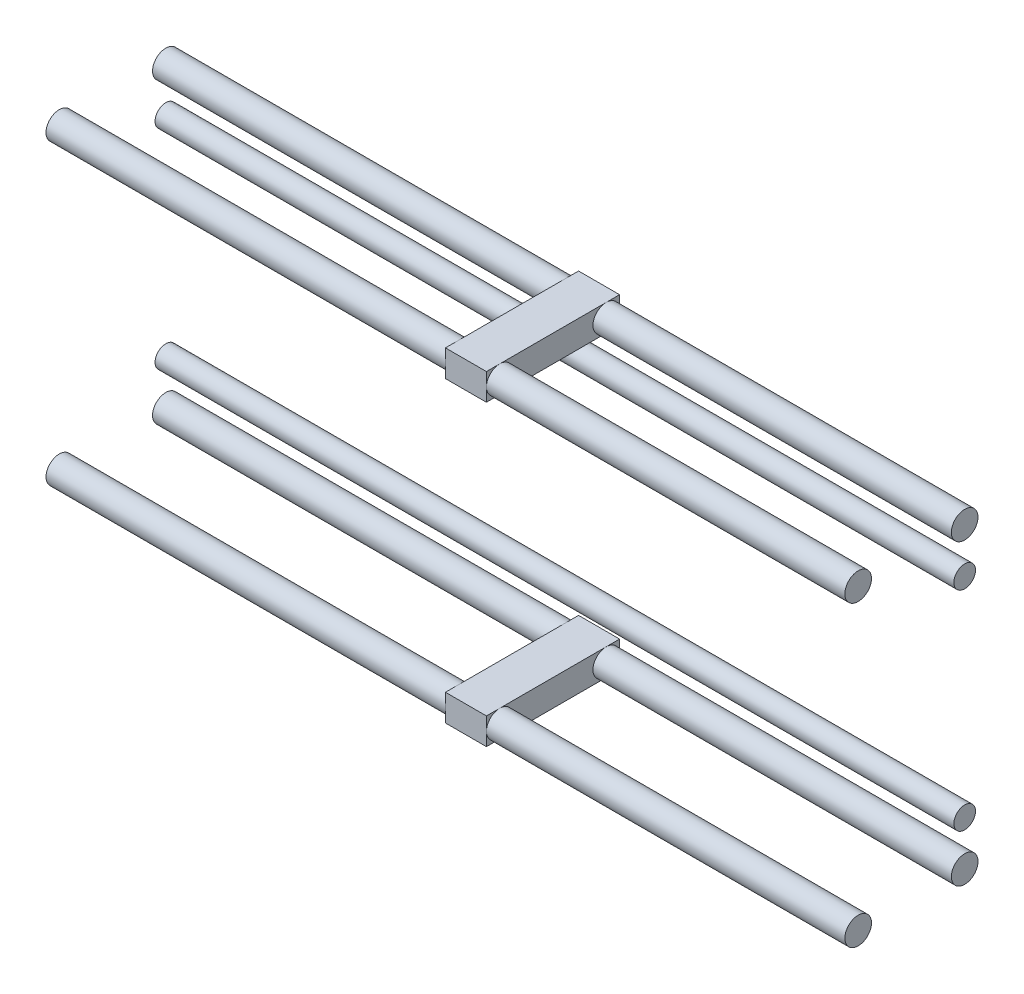
ISO-10303-21;
HEADER;
FILE_DESCRIPTION(('STEP AP214'),'2;1');
FILE_NAME('part.step','',(''),(''),'','','');
FILE_SCHEMA(('AUTOMOTIVE_DESIGN { 1 0 10303 214 1 1 1 1 }'));
ENDSEC;
DATA;
#1=APPLICATION_CONTEXT('core data for automotive mechanical design processes');
#2=APPLICATION_PROTOCOL_DEFINITION('international standard','automotive_design',2000,#1);
#3=PRODUCT_CONTEXT('',#1,'mechanical');
#4=PRODUCT('Part','Part','',(#3));
#5=PRODUCT_RELATED_PRODUCT_CATEGORY('part','',(#4));
#6=PRODUCT_DEFINITION_FORMATION('','',#4);
#7=PRODUCT_DEFINITION_CONTEXT('part definition',#1,'design');
#8=PRODUCT_DEFINITION('design','',#6,#7);
#9=PRODUCT_DEFINITION_SHAPE('','',#8);
#10=(LENGTH_UNIT() NAMED_UNIT(*) SI_UNIT(.MILLI.,.METRE.));
#11=(NAMED_UNIT(*) PLANE_ANGLE_UNIT() SI_UNIT($,.RADIAN.));
#12=(NAMED_UNIT(*) SI_UNIT($,.STERADIAN.) SOLID_ANGLE_UNIT());
#13=UNCERTAINTY_MEASURE_WITH_UNIT(LENGTH_MEASURE(1.E-05),#10,'distance_accuracy_value','');
#14=(GEOMETRIC_REPRESENTATION_CONTEXT(3) GLOBAL_UNCERTAINTY_ASSIGNED_CONTEXT((#13)) GLOBAL_UNIT_ASSIGNED_CONTEXT((#10,
#11,#12)) REPRESENTATION_CONTEXT('',''));
#15=CARTESIAN_POINT('',(0.,0.,0.));
#16=DIRECTION('',(0.,0.,1.));
#17=DIRECTION('',(1.,0.,0.));
#18=AXIS2_PLACEMENT_3D('',#15,#16,#17);
#19=CARTESIAN_POINT('',(-75.,-3.26576754328882,-12.1284424453869));
#20=DIRECTION('',(1.,0.,0.));
#21=DIRECTION('',(0.,0.,-1.));
#22=AXIS2_PLACEMENT_3D('',#19,#20,#21);
#23=CYLINDRICAL_SURFACE('',#22,2.03);
#24=CARTESIAN_POINT('',(-75.,-3.26576754328882,-12.1284424453869));
#25=DIRECTION('',(-1.,0.,0.));
#26=DIRECTION('',(0.,0.,1.));
#27=AXIS2_PLACEMENT_3D('',#24,#25,#26);
#28=CIRCLE('',#27,2.03);
#29=CARTESIAN_POINT('',(-75.,-3.26576754328882,-10.0984424453869));
#30=VERTEX_POINT('',#29);
#31=EDGE_CURVE('E52',#30,#30,#28,.T.);
#32=ORIENTED_EDGE('',*,*,#31,.F.);
#33=EDGE_LOOP('',(#32));
#34=FACE_BOUND('',#33,.T.);
#35=CARTESIAN_POINT('',(75.,-3.26576754328882,-12.1284424453869));
#36=DIRECTION('',(-1.,0.,0.));
#37=DIRECTION('',(0.,0.,1.));
#38=AXIS2_PLACEMENT_3D('',#35,#36,#37);
#39=CIRCLE('',#38,2.03);
#40=CARTESIAN_POINT('',(75.,-3.26576754328882,-10.0984424453869));
#41=VERTEX_POINT('',#40);
#42=EDGE_CURVE('E11',#41,#41,#39,.T.);
#43=ORIENTED_EDGE('',*,*,#42,.T.);
#44=EDGE_LOOP('',(#43));
#45=FACE_BOUND('',#44,.T.);
#46=ADVANCED_FACE('F48',(#34,#45),#23,.T.);
#47=CARTESIAN_POINT('',(-75.,-3.26576754328882,-12.1284424453869));
#48=DIRECTION('',(-1.,0.,0.));
#49=DIRECTION('',(0.,0.,1.));
#50=AXIS2_PLACEMENT_3D('',#47,#48,#49);
#51=PLANE('',#50);
#52=ORIENTED_EDGE('',*,*,#31,.T.);
#53=EDGE_LOOP('',(#52));
#54=FACE_BOUND('',#53,.T.);
#55=ADVANCED_FACE('F50',(#54),#51,.T.);
#56=CARTESIAN_POINT('',(75.,-3.26576754328882,-12.1284424453869));
#57=DIRECTION('',(-1.,0.,0.));
#58=DIRECTION('',(0.,0.,1.));
#59=AXIS2_PLACEMENT_3D('',#56,#57,#58);
#60=PLANE('',#59);
#61=ORIENTED_EDGE('',*,*,#42,.F.);
#62=EDGE_LOOP('',(#61));
#63=FACE_BOUND('',#62,.T.);
#64=ADVANCED_FACE('F67',(#63),#60,.F.);
#65=CLOSED_SHELL('',(#46,#55,#64));
#66=MANIFOLD_SOLID_BREP('B2',#65);
#67=CARTESIAN_POINT('',(-75.,35.9342324567112,-12.1284424453869));
#68=DIRECTION('',(1.,0.,0.));
#69=DIRECTION('',(0.,0.,-1.));
#70=AXIS2_PLACEMENT_3D('',#67,#68,#69);
#71=CYLINDRICAL_SURFACE('',#70,2.03);
#72=CARTESIAN_POINT('',(-75.,35.9342324567112,-12.1284424453869));
#73=DIRECTION('',(-1.,0.,0.));
#74=DIRECTION('',(0.,0.,1.));
#75=AXIS2_PLACEMENT_3D('',#72,#73,#74);
#76=CIRCLE('',#75,2.03);
#77=CARTESIAN_POINT('',(-75.,35.9342324567112,-10.0984424453869));
#78=VERTEX_POINT('',#77);
#79=EDGE_CURVE('E109',#78,#78,#76,.T.);
#80=ORIENTED_EDGE('',*,*,#79,.F.);
#81=EDGE_LOOP('',(#80));
#82=FACE_BOUND('',#81,.T.);
#83=CARTESIAN_POINT('',(75.,35.9342324567112,-12.1284424453869));
#84=DIRECTION('',(-1.,0.,0.));
#85=DIRECTION('',(0.,0.,1.));
#86=AXIS2_PLACEMENT_3D('',#83,#84,#85);
#87=CIRCLE('',#86,2.03);
#88=CARTESIAN_POINT('',(75.,35.9342324567112,-10.0984424453869));
#89=VERTEX_POINT('',#88);
#90=EDGE_CURVE('E47',#89,#89,#87,.T.);
#91=ORIENTED_EDGE('',*,*,#90,.T.);
#92=EDGE_LOOP('',(#91));
#93=FACE_BOUND('',#92,.T.);
#94=ADVANCED_FACE('F105',(#82,#93),#71,.T.);
#95=CARTESIAN_POINT('',(-75.,35.9342324567112,-12.1284424453869));
#96=DIRECTION('',(-1.,0.,0.));
#97=DIRECTION('',(0.,0.,1.));
#98=AXIS2_PLACEMENT_3D('',#95,#96,#97);
#99=PLANE('',#98);
#100=ORIENTED_EDGE('',*,*,#79,.T.);
#101=EDGE_LOOP('',(#100));
#102=FACE_BOUND('',#101,.T.);
#103=ADVANCED_FACE('F107',(#102),#99,.T.);
#104=CARTESIAN_POINT('',(75.,35.9342324567112,-12.1284424453869));
#105=DIRECTION('',(-1.,0.,0.));
#106=DIRECTION('',(0.,0.,1.));
#107=AXIS2_PLACEMENT_3D('',#104,#105,#106);
#108=PLANE('',#107);
#109=ORIENTED_EDGE('',*,*,#90,.F.);
#110=EDGE_LOOP('',(#109));
#111=FACE_BOUND('',#110,.T.);
#112=ADVANCED_FACE('F124',(#111),#108,.F.);
#113=CLOSED_SHELL('',(#94,#103,#112));
#114=MANIFOLD_SOLID_BREP('B6',#113);
#115=CARTESIAN_POINT('',(7.7,0.,0.));
#116=DIRECTION('',(-1.,0.,0.));
#117=DIRECTION('',(0.,0.,1.));
#118=AXIS2_PLACEMENT_3D('',#115,#116,#117);
#119=PLANE('',#118);
#120=CARTESIAN_POINT('',(7.7,44.3342324567112,7.87155755461312));
#121=DIRECTION('',(-1.,0.,0.));
#122=DIRECTION('',(0.,0.,1.));
#123=AXIS2_PLACEMENT_3D('',#120,#121,#122);
#124=CIRCLE('',#123,2.5);
#125=CARTESIAN_POINT('',(7.7,44.3342324567112,10.3715575546131));
#126=VERTEX_POINT('',#125);
#127=CARTESIAN_POINT('',(7.7,41.8342324567112,7.87155755461312));
#128=VERTEX_POINT('',#127);
#129=EDGE_CURVE('E319',#126,#128,#124,.F.);
#130=ORIENTED_EDGE('',*,*,#129,.F.);
#131=DIRECTION('',(0.,1.,0.));
#132=VECTOR('',#131,1.);
#133=CARTESIAN_POINT('',(7.7,41.8342324567112,10.3715575546131));
#134=LINE('',#133,#132);
#135=CARTESIAN_POINT('',(7.7,41.8342324567112,10.3715575546131));
#136=VERTEX_POINT('',#135);
#137=EDGE_CURVE('E401',#136,#126,#134,.T.);
#138=ORIENTED_EDGE('',*,*,#137,.F.);
#139=DIRECTION('',(0.,0.,-1.));
#140=VECTOR('',#139,1.);
#141=CARTESIAN_POINT('',(7.7,41.8342324567112,10.3715575546131));
#142=LINE('',#141,#140);
#143=EDGE_CURVE('E387',#136,#128,#142,.T.);
#144=ORIENTED_EDGE('',*,*,#143,.T.);
#145=EDGE_LOOP('',(#130,#138,#144));
#146=FACE_BOUND('',#145,.T.);
#147=ADVANCED_FACE('F161',(#146),#119,.F.);
#148=CARTESIAN_POINT('',(7.7,46.8342324567112,7.87155755461312));
#149=VERTEX_POINT('',#148);
#150=EDGE_CURVE('E178',#128,#149,#124,.F.);
#151=ORIENTED_EDGE('',*,*,#150,.F.);
#152=CARTESIAN_POINT('',(7.7,41.8342324567112,-12.1284424453869));
#153=VERTEX_POINT('',#152);
#154=EDGE_CURVE('E405',#128,#153,#142,.T.);
#155=ORIENTED_EDGE('',*,*,#154,.T.);
#156=CARTESIAN_POINT('',(7.7,44.3342324567112,-12.1284424453869));
#157=DIRECTION('',(-1.,0.,0.));
#158=DIRECTION('',(0.,0.,1.));
#159=AXIS2_PLACEMENT_3D('',#156,#157,#158);
#160=CIRCLE('',#159,2.5);
#161=CARTESIAN_POINT('',(7.7,46.8342324567112,-12.1284424453869));
#162=VERTEX_POINT('',#161);
#163=EDGE_CURVE('E309',#162,#153,#160,.F.);
#164=ORIENTED_EDGE('',*,*,#163,.F.);
#165=DIRECTION('',(0.,0.,-1.));
#166=VECTOR('',#165,1.);
#167=CARTESIAN_POINT('',(7.7,46.8342324567112,10.3715575546131));
#168=LINE('',#167,#166);
#169=EDGE_CURVE('E415',#149,#162,#168,.T.);
#170=ORIENTED_EDGE('',*,*,#169,.F.);
#171=EDGE_LOOP('',(#151,#155,#164,#170));
#172=FACE_BOUND('',#171,.T.);
#173=ADVANCED_FACE('F346',(#172),#119,.F.);
#174=CARTESIAN_POINT('',(0.,0.,0.));
#175=DIRECTION('',(-1.,0.,0.));
#176=DIRECTION('',(0.,0.,1.));
#177=AXIS2_PLACEMENT_3D('',#174,#175,#176);
#178=PLANE('',#177);
#179=DIRECTION('',(0.,1.,0.));
#180=VECTOR('',#179,1.);
#181=CARTESIAN_POINT('',(0.,41.8342324567112,10.3715575546131));
#182=LINE('',#181,#180);
#183=CARTESIAN_POINT('',(0.,41.8342324567112,10.3715575546131));
#184=VERTEX_POINT('',#183);
#185=CARTESIAN_POINT('',(0.,44.3342324567112,10.3715575546131));
#186=VERTEX_POINT('',#185);
#187=EDGE_CURVE('E275',#184,#186,#182,.T.);
#188=ORIENTED_EDGE('',*,*,#187,.T.);
#189=CARTESIAN_POINT('',(0.,44.3342324567112,7.87155755461312));
#190=DIRECTION('',(-1.,0.,0.));
#191=DIRECTION('',(0.,0.,1.));
#192=AXIS2_PLACEMENT_3D('',#189,#190,#191);
#193=CIRCLE('',#192,2.5);
#194=CARTESIAN_POINT('',(0.,41.8342324567112,7.87155755461312));
#195=VERTEX_POINT('',#194);
#196=EDGE_CURVE('E103',#186,#195,#193,.F.);
#197=ORIENTED_EDGE('',*,*,#196,.T.);
#198=DIRECTION('',(0.,0.,-1.));
#199=VECTOR('',#198,1.);
#200=CARTESIAN_POINT('',(0.,41.8342324567112,10.3715575546131));
#201=LINE('',#200,#199);
#202=EDGE_CURVE('E290',#184,#195,#201,.T.);
#203=ORIENTED_EDGE('',*,*,#202,.F.);
#204=EDGE_LOOP('',(#188,#197,#203));
#205=FACE_BOUND('',#204,.T.);
#206=ADVANCED_FACE('F351',(#205),#178,.T.);
#207=CARTESIAN_POINT('',(0.,41.8342324567112,-12.1284424453869));
#208=VERTEX_POINT('',#207);
#209=EDGE_CURVE('E256',#195,#208,#201,.T.);
#210=ORIENTED_EDGE('',*,*,#209,.F.);
#211=CARTESIAN_POINT('',(0.,46.8342324567112,7.87155755461312));
#212=VERTEX_POINT('',#211);
#213=EDGE_CURVE('E171',#195,#212,#193,.F.);
#214=ORIENTED_EDGE('',*,*,#213,.T.);
#215=DIRECTION('',(0.,0.,-1.));
#216=VECTOR('',#215,1.);
#217=CARTESIAN_POINT('',(0.,46.8342324567112,10.3715575546131));
#218=LINE('',#217,#216);
#219=CARTESIAN_POINT('',(0.,46.8342324567112,-12.1284424453869));
#220=VERTEX_POINT('',#219);
#221=EDGE_CURVE('E254',#212,#220,#218,.T.);
#222=ORIENTED_EDGE('',*,*,#221,.T.);
#223=CARTESIAN_POINT('',(0.,44.3342324567112,-12.1284424453869));
#224=DIRECTION('',(-1.,0.,0.));
#225=DIRECTION('',(0.,0.,1.));
#226=AXIS2_PLACEMENT_3D('',#223,#224,#225);
#227=CIRCLE('',#226,2.5);
#228=EDGE_CURVE('E417',#220,#208,#227,.F.);
#229=ORIENTED_EDGE('',*,*,#228,.T.);
#230=EDGE_LOOP('',(#210,#214,#222,#229));
#231=FACE_BOUND('',#230,.T.);
#232=ADVANCED_FACE('F252',(#231),#178,.T.);
#233=CARTESIAN_POINT('',(7.7,44.3342324567112,-14.6284424453869));
#234=VERTEX_POINT('',#233);
#235=EDGE_CURVE('E299',#153,#234,#160,.F.);
#236=ORIENTED_EDGE('',*,*,#235,.F.);
#237=CARTESIAN_POINT('',(7.7,41.8342324567112,-14.6284424453869));
#238=VERTEX_POINT('',#237);
#239=EDGE_CURVE('E308',#153,#238,#142,.T.);
#240=ORIENTED_EDGE('',*,*,#239,.T.);
#241=DIRECTION('',(0.,1.,0.));
#242=VECTOR('',#241,1.);
#243=CARTESIAN_POINT('',(7.7,41.8342324567112,-14.6284424453869));
#244=LINE('',#243,#242);
#245=EDGE_CURVE('E385',#238,#234,#244,.T.);
#246=ORIENTED_EDGE('',*,*,#245,.T.);
#247=EDGE_LOOP('',(#236,#240,#246));
#248=FACE_BOUND('',#247,.T.);
#249=ADVANCED_FACE('F352',(#248),#119,.F.);
#250=EDGE_CURVE('E313',#234,#162,#160,.F.);
#251=ORIENTED_EDGE('',*,*,#250,.F.);
#252=CARTESIAN_POINT('',(7.7,46.8342324567112,-14.6284424453869));
#253=VERTEX_POINT('',#252);
#254=EDGE_CURVE('E377',#234,#253,#244,.T.);
#255=ORIENTED_EDGE('',*,*,#254,.T.);
#256=EDGE_CURVE('E379',#162,#253,#168,.T.);
#257=ORIENTED_EDGE('',*,*,#256,.F.);
#258=EDGE_LOOP('',(#251,#255,#257));
#259=FACE_BOUND('',#258,.T.);
#260=ADVANCED_FACE('F355',(#259),#119,.F.);
#261=CARTESIAN_POINT('',(0.,41.8342324567112,-14.6284424453869));
#262=VERTEX_POINT('',#261);
#263=EDGE_CURVE('E294',#208,#262,#201,.T.);
#264=ORIENTED_EDGE('',*,*,#263,.F.);
#265=CARTESIAN_POINT('',(0.,44.3342324567112,-14.6284424453869));
#266=VERTEX_POINT('',#265);
#267=EDGE_CURVE('E248',#208,#266,#227,.F.);
#268=ORIENTED_EDGE('',*,*,#267,.T.);
#269=DIRECTION('',(0.,1.,0.));
#270=VECTOR('',#269,1.);
#271=CARTESIAN_POINT('',(0.,41.8342324567112,-14.6284424453869));
#272=LINE('',#271,#270);
#273=EDGE_CURVE('E279',#262,#266,#272,.T.);
#274=ORIENTED_EDGE('',*,*,#273,.F.);
#275=EDGE_LOOP('',(#264,#268,#274));
#276=FACE_BOUND('',#275,.T.);
#277=ADVANCED_FACE('F365',(#276),#178,.T.);
#278=CARTESIAN_POINT('',(0.,46.8342324567112,-14.6284424453869));
#279=VERTEX_POINT('',#278);
#280=EDGE_CURVE('E285',#266,#279,#272,.T.);
#281=ORIENTED_EDGE('',*,*,#280,.F.);
#282=EDGE_CURVE('E419',#266,#220,#227,.F.);
#283=ORIENTED_EDGE('',*,*,#282,.T.);
#284=EDGE_CURVE('E267',#220,#279,#218,.T.);
#285=ORIENTED_EDGE('',*,*,#284,.T.);
#286=EDGE_LOOP('',(#281,#283,#285));
#287=FACE_BOUND('',#286,.T.);
#288=ADVANCED_FACE('F361',(#287),#178,.T.);
#289=CARTESIAN_POINT('',(7.7,41.8342324567112,10.3715575546131));
#290=DIRECTION('',(0.,0.,1.));
#291=DIRECTION('',(1.,0.,0.));
#292=AXIS2_PLACEMENT_3D('',#289,#290,#291);
#293=PLANE('',#292);
#294=CARTESIAN_POINT('',(0.,46.8342324567112,10.3715575546131));
#295=VERTEX_POINT('',#294);
#296=EDGE_CURVE('E271',#186,#295,#182,.T.);
#297=ORIENTED_EDGE('',*,*,#296,.F.);
#298=ORIENTED_EDGE('',*,*,#187,.F.);
#299=DIRECTION('',(-1.,0.,0.));
#300=VECTOR('',#299,1.);
#301=CARTESIAN_POINT('',(7.7,41.8342324567112,10.3715575546131));
#302=LINE('',#301,#300);
#303=EDGE_CURVE('E295',#136,#184,#302,.T.);
#304=ORIENTED_EDGE('',*,*,#303,.F.);
#305=ORIENTED_EDGE('',*,*,#137,.T.);
#306=CARTESIAN_POINT('',(7.7,46.8342324567112,10.3715575546131));
#307=VERTEX_POINT('',#306);
#308=EDGE_CURVE('E414',#126,#307,#134,.T.);
#309=ORIENTED_EDGE('',*,*,#308,.T.);
#310=DIRECTION('',(-1.,0.,0.));
#311=VECTOR('',#310,1.);
#312=CARTESIAN_POINT('',(7.7,46.8342324567112,10.3715575546131));
#313=LINE('',#312,#311);
#314=EDGE_CURVE('E305',#307,#295,#313,.T.);
#315=ORIENTED_EDGE('',*,*,#314,.T.);
#316=EDGE_LOOP('',(#297,#298,#304,#305,#309,#315));
#317=FACE_BOUND('',#316,.T.);
#318=ADVANCED_FACE('F444',(#317),#293,.T.);
#319=CARTESIAN_POINT('',(7.7,41.8342324567112,10.3715575546131));
#320=DIRECTION('',(0.,1.,0.));
#321=DIRECTION('',(0.,0.,1.));
#322=AXIS2_PLACEMENT_3D('',#319,#320,#321);
#323=PLANE('',#322);
#324=ORIENTED_EDGE('',*,*,#154,.F.);
#325=ORIENTED_EDGE('',*,*,#143,.F.);
#326=ORIENTED_EDGE('',*,*,#303,.T.);
#327=ORIENTED_EDGE('',*,*,#202,.T.);
#328=ORIENTED_EDGE('',*,*,#209,.T.);
#329=ORIENTED_EDGE('',*,*,#263,.T.);
#330=DIRECTION('',(-1.,0.,0.));
#331=VECTOR('',#330,1.);
#332=CARTESIAN_POINT('',(7.7,41.8342324567112,-14.6284424453869));
#333=LINE('',#332,#331);
#334=EDGE_CURVE('E298',#238,#262,#333,.T.);
#335=ORIENTED_EDGE('',*,*,#334,.F.);
#336=ORIENTED_EDGE('',*,*,#239,.F.);
#337=EDGE_LOOP('',(#324,#325,#326,#327,#328,#329,#335,#336));
#338=FACE_BOUND('',#337,.T.);
#339=ADVANCED_FACE('F446',(#338),#323,.F.);
#340=CARTESIAN_POINT('',(7.7,41.8342324567112,-14.6284424453869));
#341=DIRECTION('',(0.,0.,1.));
#342=DIRECTION('',(1.,0.,0.));
#343=AXIS2_PLACEMENT_3D('',#340,#341,#342);
#344=PLANE('',#343);
#345=ORIENTED_EDGE('',*,*,#254,.F.);
#346=ORIENTED_EDGE('',*,*,#245,.F.);
#347=ORIENTED_EDGE('',*,*,#334,.T.);
#348=ORIENTED_EDGE('',*,*,#273,.T.);
#349=ORIENTED_EDGE('',*,*,#280,.T.);
#350=DIRECTION('',(-1.,0.,0.));
#351=VECTOR('',#350,1.);
#352=CARTESIAN_POINT('',(7.7,46.8342324567112,-14.6284424453869));
#353=LINE('',#352,#351);
#354=EDGE_CURVE('E302',#253,#279,#353,.T.);
#355=ORIENTED_EDGE('',*,*,#354,.F.);
#356=EDGE_LOOP('',(#345,#346,#347,#348,#349,#355));
#357=FACE_BOUND('',#356,.T.);
#358=ADVANCED_FACE('F362',(#357),#344,.F.);
#359=CARTESIAN_POINT('',(7.7,46.8342324567112,10.3715575546131));
#360=DIRECTION('',(0.,1.,0.));
#361=DIRECTION('',(0.,0.,1.));
#362=AXIS2_PLACEMENT_3D('',#359,#360,#361);
#363=PLANE('',#362);
#364=ORIENTED_EDGE('',*,*,#221,.F.);
#365=EDGE_CURVE('E264',#295,#212,#218,.T.);
#366=ORIENTED_EDGE('',*,*,#365,.F.);
#367=ORIENTED_EDGE('',*,*,#314,.F.);
#368=EDGE_CURVE('E410',#307,#149,#168,.T.);
#369=ORIENTED_EDGE('',*,*,#368,.T.);
#370=ORIENTED_EDGE('',*,*,#169,.T.);
#371=ORIENTED_EDGE('',*,*,#256,.T.);
#372=ORIENTED_EDGE('',*,*,#354,.T.);
#373=ORIENTED_EDGE('',*,*,#284,.F.);
#374=EDGE_LOOP('',(#364,#366,#367,#369,#370,#371,#372,#373));
#375=FACE_BOUND('',#374,.T.);
#376=ADVANCED_FACE('F262',(#375),#363,.T.);
#377=EDGE_CURVE('E186',#149,#126,#124,.F.);
#378=ORIENTED_EDGE('',*,*,#377,.F.);
#379=ORIENTED_EDGE('',*,*,#368,.F.);
#380=ORIENTED_EDGE('',*,*,#308,.F.);
#381=EDGE_LOOP('',(#378,#379,#380));
#382=FACE_BOUND('',#381,.T.);
#383=ADVANCED_FACE('F163',(#382),#119,.F.);
#384=ORIENTED_EDGE('',*,*,#365,.T.);
#385=EDGE_CURVE('E165',#212,#186,#193,.F.);
#386=ORIENTED_EDGE('',*,*,#385,.T.);
#387=ORIENTED_EDGE('',*,*,#296,.T.);
#388=EDGE_LOOP('',(#384,#386,#387));
#389=FACE_BOUND('',#388,.T.);
#390=ADVANCED_FACE('F270',(#389),#178,.T.);
#391=CARTESIAN_POINT('',(-75.,44.3342324567112,-12.1284424453869));
#392=DIRECTION('',(-1.,0.,0.));
#393=DIRECTION('',(0.,0.,1.));
#394=AXIS2_PLACEMENT_3D('',#391,#392,#393);
#395=PLANE('',#394);
#396=CARTESIAN_POINT('',(-75.,44.3342324567112,-12.1284424453869));
#397=DIRECTION('',(-1.,0.,0.));
#398=DIRECTION('',(0.,0.,1.));
#399=AXIS2_PLACEMENT_3D('',#396,#397,#398);
#400=CIRCLE('',#399,2.5);
#401=CARTESIAN_POINT('',(-75.,44.3342324567112,-9.62844244538689));
#402=VERTEX_POINT('',#401);
#403=EDGE_CURVE('E314',#402,#402,#400,.T.);
#404=ORIENTED_EDGE('',*,*,#403,.T.);
#405=EDGE_LOOP('',(#404));
#406=FACE_BOUND('',#405,.T.);
#407=ADVANCED_FACE('F360',(#406),#395,.T.);
#408=CARTESIAN_POINT('',(-75.,44.3342324567112,-12.1284424453869));
#409=DIRECTION('',(1.,0.,0.));
#410=DIRECTION('',(0.,0.,-1.));
#411=AXIS2_PLACEMENT_3D('',#408,#409,#410);
#412=CYLINDRICAL_SURFACE('',#411,2.5);
#413=ORIENTED_EDGE('',*,*,#267,.F.);
#414=ORIENTED_EDGE('',*,*,#228,.F.);
#415=ORIENTED_EDGE('',*,*,#282,.F.);
#416=EDGE_LOOP('',(#413,#414,#415));
#417=FACE_BOUND('',#416,.T.);
#418=ORIENTED_EDGE('',*,*,#403,.F.);
#419=EDGE_LOOP('',(#418));
#420=FACE_BOUND('',#419,.T.);
#421=ADVANCED_FACE('F428',(#417,#420),#412,.T.);
#422=CARTESIAN_POINT('',(75.,44.3342324567112,-12.1284424453869));
#423=DIRECTION('',(-1.,0.,0.));
#424=DIRECTION('',(0.,0.,1.));
#425=AXIS2_PLACEMENT_3D('',#422,#423,#424);
#426=CIRCLE('',#425,2.5);
#427=CARTESIAN_POINT('',(75.,44.3342324567112,-9.62844244538689));
#428=VERTEX_POINT('',#427);
#429=EDGE_CURVE('E315',#428,#428,#426,.T.);
#430=ORIENTED_EDGE('',*,*,#429,.T.);
#431=EDGE_LOOP('',(#430));
#432=FACE_BOUND('',#431,.T.);
#433=ORIENTED_EDGE('',*,*,#163,.T.);
#434=ORIENTED_EDGE('',*,*,#235,.T.);
#435=ORIENTED_EDGE('',*,*,#250,.T.);
#436=EDGE_LOOP('',(#433,#434,#435));
#437=FACE_BOUND('',#436,.T.);
#438=ADVANCED_FACE('F393',(#432,#437),#412,.T.);
#439=CARTESIAN_POINT('',(75.,44.3342324567112,-12.1284424453869));
#440=DIRECTION('',(-1.,0.,0.));
#441=DIRECTION('',(0.,0.,1.));
#442=AXIS2_PLACEMENT_3D('',#439,#440,#441);
#443=PLANE('',#442);
#444=ORIENTED_EDGE('',*,*,#429,.F.);
#445=EDGE_LOOP('',(#444));
#446=FACE_BOUND('',#445,.T.);
#447=ADVANCED_FACE('F440',(#446),#443,.F.);
#448=CARTESIAN_POINT('',(-75.,44.3342324567112,7.87155755461312));
#449=DIRECTION('',(-1.,0.,0.));
#450=DIRECTION('',(0.,0.,1.));
#451=AXIS2_PLACEMENT_3D('',#448,#449,#450);
#452=PLANE('',#451);
#453=CARTESIAN_POINT('',(-75.,44.3342324567112,7.87155755461312));
#454=DIRECTION('',(-1.,0.,0.));
#455=DIRECTION('',(0.,0.,1.));
#456=AXIS2_PLACEMENT_3D('',#453,#454,#455);
#457=CIRCLE('',#456,2.5);
#458=CARTESIAN_POINT('',(-75.,44.3342324567112,10.3715575546131));
#459=VERTEX_POINT('',#458);
#460=EDGE_CURVE('E326',#459,#459,#457,.T.);
#461=ORIENTED_EDGE('',*,*,#460,.T.);
#462=EDGE_LOOP('',(#461));
#463=FACE_BOUND('',#462,.T.);
#464=ADVANCED_FACE('F439',(#463),#452,.T.);
#465=CARTESIAN_POINT('',(-75.,44.3342324567112,7.87155755461312));
#466=DIRECTION('',(1.,0.,0.));
#467=DIRECTION('',(0.,0.,-1.));
#468=AXIS2_PLACEMENT_3D('',#465,#466,#467);
#469=CYLINDRICAL_SURFACE('',#468,2.5);
#470=ORIENTED_EDGE('',*,*,#196,.F.);
#471=ORIENTED_EDGE('',*,*,#385,.F.);
#472=ORIENTED_EDGE('',*,*,#213,.F.);
#473=EDGE_LOOP('',(#470,#471,#472));
#474=FACE_BOUND('',#473,.T.);
#475=ORIENTED_EDGE('',*,*,#460,.F.);
#476=EDGE_LOOP('',(#475));
#477=FACE_BOUND('',#476,.T.);
#478=ADVANCED_FACE('F242',(#474,#477),#469,.T.);
#479=CARTESIAN_POINT('',(75.,44.3342324567112,7.87155755461312));
#480=DIRECTION('',(-1.,0.,0.));
#481=DIRECTION('',(0.,0.,1.));
#482=AXIS2_PLACEMENT_3D('',#479,#480,#481);
#483=CIRCLE('',#482,2.5);
#484=CARTESIAN_POINT('',(75.,44.3342324567112,10.3715575546131));
#485=VERTEX_POINT('',#484);
#486=EDGE_CURVE('E325',#485,#485,#483,.T.);
#487=ORIENTED_EDGE('',*,*,#486,.T.);
#488=EDGE_LOOP('',(#487));
#489=FACE_BOUND('',#488,.T.);
#490=ORIENTED_EDGE('',*,*,#377,.T.);
#491=ORIENTED_EDGE('',*,*,#129,.T.);
#492=ORIENTED_EDGE('',*,*,#150,.T.);
#493=EDGE_LOOP('',(#490,#491,#492));
#494=FACE_BOUND('',#493,.T.);
#495=ADVANCED_FACE('F334',(#489,#494),#469,.T.);
#496=CARTESIAN_POINT('',(75.,44.3342324567112,7.87155755461312));
#497=DIRECTION('',(-1.,0.,0.));
#498=DIRECTION('',(0.,0.,1.));
#499=AXIS2_PLACEMENT_3D('',#496,#497,#498);
#500=PLANE('',#499);
#501=ORIENTED_EDGE('',*,*,#486,.F.);
#502=EDGE_LOOP('',(#501));
#503=FACE_BOUND('',#502,.T.);
#504=ADVANCED_FACE('F337',(#503),#500,.F.);
#505=CLOSED_SHELL('',(#147,#173,#206,#232,#249,#260,#277,#288,#318,#339,#358,#376,#383,#390,
#407,#421,#438,#447,#464,#478,#495,#504));
#506=MANIFOLD_SOLID_BREP('B42',#505);
#507=CARTESIAN_POINT('',(7.7,0.,0.));
#508=DIRECTION('',(-1.,0.,0.));
#509=DIRECTION('',(0.,0.,1.));
#510=AXIS2_PLACEMENT_3D('',#507,#508,#509);
#511=PLANE('',#510);
#512=CARTESIAN_POINT('',(7.7,-11.6657675432888,-12.1284424453869));
#513=DIRECTION('',(-1.,0.,0.));
#514=DIRECTION('',(0.,0.,1.));
#515=AXIS2_PLACEMENT_3D('',#512,#513,#514);
#516=CIRCLE('',#515,2.5);
#517=CARTESIAN_POINT('',(7.7,-14.1657675432888,-12.1284424453869));
#518=VERTEX_POINT('',#517);
#519=CARTESIAN_POINT('',(7.7,-11.6657675432888,-14.6284424453869));
#520=VERTEX_POINT('',#519);
#521=EDGE_CURVE('E735',#518,#520,#516,.F.);
#522=ORIENTED_EDGE('',*,*,#521,.F.);
#523=DIRECTION('',(0.,0.,-1.));
#524=VECTOR('',#523,1.);
#525=CARTESIAN_POINT('',(7.7,-14.1657675432888,10.3715575546131));
#526=LINE('',#525,#524);
#527=CARTESIAN_POINT('',(7.7,-14.1657675432888,-14.6284424453869));
#528=VERTEX_POINT('',#527);
#529=EDGE_CURVE('E774',#518,#528,#526,.T.);
#530=ORIENTED_EDGE('',*,*,#529,.T.);
#531=DIRECTION('',(0.,1.,0.));
#532=VECTOR('',#531,1.);
#533=CARTESIAN_POINT('',(7.7,-14.1657675432888,-14.6284424453869));
#534=LINE('',#533,#532);
#535=EDGE_CURVE('E781',#528,#520,#534,.T.);
#536=ORIENTED_EDGE('',*,*,#535,.T.);
#537=EDGE_LOOP('',(#522,#530,#536));
#538=FACE_BOUND('',#537,.T.);
#539=ADVANCED_FACE('F639',(#538),#511,.F.);
#540=CARTESIAN_POINT('',(7.7,-9.16576754328882,-12.1284424453869));
#541=VERTEX_POINT('',#540);
#542=EDGE_CURVE('E663',#520,#541,#516,.F.);
#543=ORIENTED_EDGE('',*,*,#542,.F.);
#544=CARTESIAN_POINT('',(7.7,-9.16576754328882,-14.6284424453869));
#545=VERTEX_POINT('',#544);
#546=EDGE_CURVE('E787',#520,#545,#534,.T.);
#547=ORIENTED_EDGE('',*,*,#546,.T.);
#548=DIRECTION('',(0.,0.,-1.));
#549=VECTOR('',#548,1.);
#550=CARTESIAN_POINT('',(7.7,-9.16576754328882,10.3715575546131));
#551=LINE('',#550,#549);
#552=EDGE_CURVE('E795',#541,#545,#551,.T.);
#553=ORIENTED_EDGE('',*,*,#552,.F.);
#554=EDGE_LOOP('',(#543,#547,#553));
#555=FACE_BOUND('',#554,.T.);
#556=ADVANCED_FACE('F830',(#555),#511,.F.);
#557=CARTESIAN_POINT('',(0.,0.,0.));
#558=DIRECTION('',(-1.,0.,0.));
#559=DIRECTION('',(0.,0.,1.));
#560=AXIS2_PLACEMENT_3D('',#557,#558,#559);
#561=PLANE('',#560);
#562=DIRECTION('',(0.,0.,-1.));
#563=VECTOR('',#562,1.);
#564=CARTESIAN_POINT('',(0.,-14.1657675432888,10.3715575546131));
#565=LINE('',#564,#563);
#566=CARTESIAN_POINT('',(0.,-14.1657675432888,-12.1284424453869));
#567=VERTEX_POINT('',#566);
#568=CARTESIAN_POINT('',(0.,-14.1657675432888,-14.6284424453869));
#569=VERTEX_POINT('',#568);
#570=EDGE_CURVE('E755',#567,#569,#565,.T.);
#571=ORIENTED_EDGE('',*,*,#570,.F.);
#572=CARTESIAN_POINT('',(0.,-11.6657675432888,-12.1284424453869));
#573=DIRECTION('',(-1.,0.,0.));
#574=DIRECTION('',(0.,0.,1.));
#575=AXIS2_PLACEMENT_3D('',#572,#573,#574);
#576=CIRCLE('',#575,2.5);
#577=CARTESIAN_POINT('',(0.,-11.6657675432888,-14.6284424453869));
#578=VERTEX_POINT('',#577);
#579=EDGE_CURVE('E655',#567,#578,#576,.F.);
#580=ORIENTED_EDGE('',*,*,#579,.T.);
#581=DIRECTION('',(0.,1.,0.));
#582=VECTOR('',#581,1.);
#583=CARTESIAN_POINT('',(0.,-14.1657675432888,-14.6284424453869));
#584=LINE('',#583,#582);
#585=EDGE_CURVE('E753',#569,#578,#584,.T.);
#586=ORIENTED_EDGE('',*,*,#585,.F.);
#587=EDGE_LOOP('',(#571,#580,#586));
#588=FACE_BOUND('',#587,.T.);
#589=ADVANCED_FACE('F836',(#588),#561,.T.);
#590=CARTESIAN_POINT('',(0.,-9.16576754328882,-14.6284424453869));
#591=VERTEX_POINT('',#590);
#592=EDGE_CURVE('E733',#578,#591,#584,.T.);
#593=ORIENTED_EDGE('',*,*,#592,.F.);
#594=CARTESIAN_POINT('',(0.,-9.16576754328882,-12.1284424453869));
#595=VERTEX_POINT('',#594);
#596=EDGE_CURVE('E719',#578,#595,#576,.F.);
#597=ORIENTED_EDGE('',*,*,#596,.T.);
#598=DIRECTION('',(0.,0.,-1.));
#599=VECTOR('',#598,1.);
#600=CARTESIAN_POINT('',(0.,-9.16576754328882,10.3715575546131));
#601=LINE('',#600,#599);
#602=EDGE_CURVE('E731',#595,#591,#601,.T.);
#603=ORIENTED_EDGE('',*,*,#602,.T.);
#604=EDGE_LOOP('',(#593,#597,#603));
#605=FACE_BOUND('',#604,.T.);
#606=ADVANCED_FACE('F730',(#605),#561,.T.);
#607=CARTESIAN_POINT('',(7.7,-11.6657675432888,7.87155755461312));
#608=DIRECTION('',(-1.,0.,0.));
#609=DIRECTION('',(0.,0.,1.));
#610=AXIS2_PLACEMENT_3D('',#607,#608,#609);
#611=CIRCLE('',#610,2.5);
#612=CARTESIAN_POINT('',(7.7,-11.6657675432888,10.3715575546131));
#613=VERTEX_POINT('',#612);
#614=CARTESIAN_POINT('',(7.7,-14.1657675432888,7.87155755461312));
#615=VERTEX_POINT('',#614);
#616=EDGE_CURVE('E803',#613,#615,#611,.F.);
#617=ORIENTED_EDGE('',*,*,#616,.F.);
#618=DIRECTION('',(0.,1.,0.));
#619=VECTOR('',#618,1.);
#620=CARTESIAN_POINT('',(7.7,-14.1657675432888,10.3715575546131));
#621=LINE('',#620,#619);
#622=CARTESIAN_POINT('',(7.7,-14.1657675432888,10.3715575546131));
#623=VERTEX_POINT('',#622);
#624=EDGE_CURVE('E796',#623,#613,#621,.T.);
#625=ORIENTED_EDGE('',*,*,#624,.F.);
#626=EDGE_CURVE('E768',#623,#615,#526,.T.);
#627=ORIENTED_EDGE('',*,*,#626,.T.);
#628=EDGE_LOOP('',(#617,#625,#627));
#629=FACE_BOUND('',#628,.T.);
#630=ADVANCED_FACE('F837',(#629),#511,.F.);
#631=EDGE_CURVE('E809',#541,#518,#516,.F.);
#632=ORIENTED_EDGE('',*,*,#631,.F.);
#633=CARTESIAN_POINT('',(7.7,-9.16576754328883,7.87155755461312));
#634=VERTEX_POINT('',#633);
#635=EDGE_CURVE('E794',#634,#541,#551,.T.);
#636=ORIENTED_EDGE('',*,*,#635,.F.);
#637=EDGE_CURVE('E801',#615,#634,#611,.F.);
#638=ORIENTED_EDGE('',*,*,#637,.F.);
#639=EDGE_CURVE('E773',#615,#518,#526,.T.);
#640=ORIENTED_EDGE('',*,*,#639,.T.);
#641=EDGE_LOOP('',(#632,#636,#638,#640));
#642=FACE_BOUND('',#641,.T.);
#643=ADVANCED_FACE('F843',(#642),#511,.F.);
#644=DIRECTION('',(0.,1.,0.));
#645=VECTOR('',#644,1.);
#646=CARTESIAN_POINT('',(0.,-14.1657675432888,10.3715575546131));
#647=LINE('',#646,#645);
#648=CARTESIAN_POINT('',(0.,-14.1657675432888,10.3715575546131));
#649=VERTEX_POINT('',#648);
#650=CARTESIAN_POINT('',(0.,-11.6657675432888,10.3715575546131));
#651=VERTEX_POINT('',#650);
#652=EDGE_CURVE('E745',#649,#651,#647,.T.);
#653=ORIENTED_EDGE('',*,*,#652,.T.);
#654=CARTESIAN_POINT('',(0.,-11.6657675432888,7.87155755461312));
#655=DIRECTION('',(-1.,0.,0.));
#656=DIRECTION('',(0.,0.,1.));
#657=AXIS2_PLACEMENT_3D('',#654,#655,#656);
#658=CIRCLE('',#657,2.5);
#659=CARTESIAN_POINT('',(0.,-14.1657675432888,7.87155755461312));
#660=VERTEX_POINT('',#659);
#661=EDGE_CURVE('E159',#651,#660,#658,.F.);
#662=ORIENTED_EDGE('',*,*,#661,.T.);
#663=EDGE_CURVE('E756',#649,#660,#565,.T.);
#664=ORIENTED_EDGE('',*,*,#663,.F.);
#665=EDGE_LOOP('',(#653,#662,#664));
#666=FACE_BOUND('',#665,.T.);
#667=ADVANCED_FACE('F852',(#666),#561,.T.);
#668=CARTESIAN_POINT('',(0.,-9.16576754328883,7.87155755461312));
#669=VERTEX_POINT('',#668);
#670=EDGE_CURVE('E740',#669,#595,#601,.T.);
#671=ORIENTED_EDGE('',*,*,#670,.T.);
#672=EDGE_CURVE('E715',#595,#567,#576,.F.);
#673=ORIENTED_EDGE('',*,*,#672,.T.);
#674=EDGE_CURVE('E760',#660,#567,#565,.T.);
#675=ORIENTED_EDGE('',*,*,#674,.F.);
#676=EDGE_CURVE('E648',#660,#669,#658,.F.);
#677=ORIENTED_EDGE('',*,*,#676,.T.);
#678=EDGE_LOOP('',(#671,#673,#675,#677));
#679=FACE_BOUND('',#678,.T.);
#680=ADVANCED_FACE('F749',(#679),#561,.T.);
#681=CARTESIAN_POINT('',(7.7,-14.1657675432888,10.3715575546131));
#682=DIRECTION('',(0.,0.,1.));
#683=DIRECTION('',(1.,0.,0.));
#684=AXIS2_PLACEMENT_3D('',#681,#682,#683);
#685=PLANE('',#684);
#686=CARTESIAN_POINT('',(0.,-9.16576754328882,10.3715575546131));
#687=VERTEX_POINT('',#686);
#688=EDGE_CURVE('E867',#651,#687,#647,.T.);
#689=ORIENTED_EDGE('',*,*,#688,.F.);
#690=ORIENTED_EDGE('',*,*,#652,.F.);
#691=DIRECTION('',(-1.,0.,0.));
#692=VECTOR('',#691,1.);
#693=CARTESIAN_POINT('',(7.7,-14.1657675432888,10.3715575546131));
#694=LINE('',#693,#692);
#695=EDGE_CURVE('E761',#623,#649,#694,.T.);
#696=ORIENTED_EDGE('',*,*,#695,.F.);
#697=ORIENTED_EDGE('',*,*,#624,.T.);
#698=CARTESIAN_POINT('',(7.7,-9.16576754328882,10.3715575546131));
#699=VERTEX_POINT('',#698);
#700=EDGE_CURVE('E759',#613,#699,#621,.T.);
#701=ORIENTED_EDGE('',*,*,#700,.T.);
#702=DIRECTION('',(-1.,0.,0.));
#703=VECTOR('',#702,1.);
#704=CARTESIAN_POINT('',(7.7,-9.16576754328882,10.3715575546131));
#705=LINE('',#704,#703);
#706=EDGE_CURVE('E766',#699,#687,#705,.T.);
#707=ORIENTED_EDGE('',*,*,#706,.T.);
#708=EDGE_LOOP('',(#689,#690,#696,#697,#701,#707));
#709=FACE_BOUND('',#708,.T.);
#710=ADVANCED_FACE('F641',(#709),#685,.T.);
#711=CARTESIAN_POINT('',(7.7,-14.1657675432888,10.3715575546131));
#712=DIRECTION('',(0.,1.,0.));
#713=DIRECTION('',(0.,0.,1.));
#714=AXIS2_PLACEMENT_3D('',#711,#712,#713);
#715=PLANE('',#714);
#716=ORIENTED_EDGE('',*,*,#529,.F.);
#717=ORIENTED_EDGE('',*,*,#639,.F.);
#718=ORIENTED_EDGE('',*,*,#626,.F.);
#719=ORIENTED_EDGE('',*,*,#695,.T.);
#720=ORIENTED_EDGE('',*,*,#663,.T.);
#721=ORIENTED_EDGE('',*,*,#674,.T.);
#722=ORIENTED_EDGE('',*,*,#570,.T.);
#723=DIRECTION('',(-1.,0.,0.));
#724=VECTOR('',#723,1.);
#725=CARTESIAN_POINT('',(7.7,-14.1657675432888,-14.6284424453869));
#726=LINE('',#725,#724);
#727=EDGE_CURVE('E763',#528,#569,#726,.T.);
#728=ORIENTED_EDGE('',*,*,#727,.F.);
#729=EDGE_LOOP('',(#716,#717,#718,#719,#720,#721,#722,#728));
#730=FACE_BOUND('',#729,.T.);
#731=ADVANCED_FACE('F873',(#730),#715,.F.);
#732=CARTESIAN_POINT('',(7.7,-14.1657675432888,-14.6284424453869));
#733=DIRECTION('',(0.,0.,1.));
#734=DIRECTION('',(1.,0.,0.));
#735=AXIS2_PLACEMENT_3D('',#732,#733,#734);
#736=PLANE('',#735);
#737=ORIENTED_EDGE('',*,*,#546,.F.);
#738=ORIENTED_EDGE('',*,*,#535,.F.);
#739=ORIENTED_EDGE('',*,*,#727,.T.);
#740=ORIENTED_EDGE('',*,*,#585,.T.);
#741=ORIENTED_EDGE('',*,*,#592,.T.);
#742=DIRECTION('',(-1.,0.,0.));
#743=VECTOR('',#742,1.);
#744=CARTESIAN_POINT('',(7.7,-9.16576754328882,-14.6284424453869));
#745=LINE('',#744,#743);
#746=EDGE_CURVE('E744',#545,#591,#745,.T.);
#747=ORIENTED_EDGE('',*,*,#746,.F.);
#748=EDGE_LOOP('',(#737,#738,#739,#740,#741,#747));
#749=FACE_BOUND('',#748,.T.);
#750=ADVANCED_FACE('F850',(#749),#736,.F.);
#751=CARTESIAN_POINT('',(7.7,-9.16576754328882,10.3715575546131));
#752=DIRECTION('',(0.,1.,0.));
#753=DIRECTION('',(0.,0.,1.));
#754=AXIS2_PLACEMENT_3D('',#751,#752,#753);
#755=PLANE('',#754);
#756=ORIENTED_EDGE('',*,*,#602,.F.);
#757=ORIENTED_EDGE('',*,*,#670,.F.);
#758=EDGE_CURVE('E747',#687,#669,#601,.T.);
#759=ORIENTED_EDGE('',*,*,#758,.F.);
#760=ORIENTED_EDGE('',*,*,#706,.F.);
#761=EDGE_CURVE('E790',#699,#634,#551,.T.);
#762=ORIENTED_EDGE('',*,*,#761,.T.);
#763=ORIENTED_EDGE('',*,*,#635,.T.);
#764=ORIENTED_EDGE('',*,*,#552,.T.);
#765=ORIENTED_EDGE('',*,*,#746,.T.);
#766=EDGE_LOOP('',(#756,#757,#759,#760,#762,#763,#764,#765));
#767=FACE_BOUND('',#766,.T.);
#768=ADVANCED_FACE('F738',(#767),#755,.T.);
#769=EDGE_CURVE('E798',#634,#613,#611,.F.);
#770=ORIENTED_EDGE('',*,*,#769,.F.);
#771=ORIENTED_EDGE('',*,*,#761,.F.);
#772=ORIENTED_EDGE('',*,*,#700,.F.);
#773=EDGE_LOOP('',(#770,#771,#772));
#774=FACE_BOUND('',#773,.T.);
#775=ADVANCED_FACE('F832',(#774),#511,.F.);
#776=ORIENTED_EDGE('',*,*,#758,.T.);
#777=EDGE_CURVE('E643',#669,#651,#658,.F.);
#778=ORIENTED_EDGE('',*,*,#777,.T.);
#779=ORIENTED_EDGE('',*,*,#688,.T.);
#780=EDGE_LOOP('',(#776,#778,#779));
#781=FACE_BOUND('',#780,.T.);
#782=ADVANCED_FACE('F841',(#781),#561,.T.);
#783=CARTESIAN_POINT('',(-75.,-11.6657675432888,7.87155755461312));
#784=DIRECTION('',(-1.,0.,0.));
#785=DIRECTION('',(0.,0.,1.));
#786=AXIS2_PLACEMENT_3D('',#783,#784,#785);
#787=PLANE('',#786);
#788=CARTESIAN_POINT('',(-75.,-11.6657675432888,7.87155755461312));
#789=DIRECTION('',(-1.,0.,0.));
#790=DIRECTION('',(0.,0.,1.));
#791=AXIS2_PLACEMENT_3D('',#788,#789,#790);
#792=CIRCLE('',#791,2.5);
#793=CARTESIAN_POINT('',(-75.,-11.6657675432888,10.3715575546131));
#794=VERTEX_POINT('',#793);
#795=EDGE_CURVE('E804',#794,#794,#792,.T.);
#796=ORIENTED_EDGE('',*,*,#795,.T.);
#797=EDGE_LOOP('',(#796));
#798=FACE_BOUND('',#797,.T.);
#799=ADVANCED_FACE('F848',(#798),#787,.T.);
#800=CARTESIAN_POINT('',(-75.,-11.6657675432888,7.87155755461312));
#801=DIRECTION('',(1.,0.,0.));
#802=DIRECTION('',(0.,0.,-1.));
#803=AXIS2_PLACEMENT_3D('',#800,#801,#802);
#804=CYLINDRICAL_SURFACE('',#803,2.5);
#805=ORIENTED_EDGE('',*,*,#661,.F.);
#806=ORIENTED_EDGE('',*,*,#777,.F.);
#807=ORIENTED_EDGE('',*,*,#676,.F.);
#808=EDGE_LOOP('',(#805,#806,#807));
#809=FACE_BOUND('',#808,.T.);
#810=ORIENTED_EDGE('',*,*,#795,.F.);
#811=EDGE_LOOP('',(#810));
#812=FACE_BOUND('',#811,.T.);
#813=ADVANCED_FACE('F918',(#809,#812),#804,.T.);
#814=CARTESIAN_POINT('',(75.,-11.6657675432888,7.87155755461312));
#815=DIRECTION('',(-1.,0.,0.));
#816=DIRECTION('',(0.,0.,1.));
#817=AXIS2_PLACEMENT_3D('',#814,#815,#816);
#818=CIRCLE('',#817,2.5);
#819=CARTESIAN_POINT('',(75.,-11.6657675432888,10.3715575546131));
#820=VERTEX_POINT('',#819);
#821=EDGE_CURVE('E802',#820,#820,#818,.T.);
#822=ORIENTED_EDGE('',*,*,#821,.T.);
#823=EDGE_LOOP('',(#822));
#824=FACE_BOUND('',#823,.T.);
#825=ORIENTED_EDGE('',*,*,#769,.T.);
#826=ORIENTED_EDGE('',*,*,#616,.T.);
#827=ORIENTED_EDGE('',*,*,#637,.T.);
#828=EDGE_LOOP('',(#825,#826,#827));
#829=FACE_BOUND('',#828,.T.);
#830=ADVANCED_FACE('F866',(#824,#829),#804,.T.);
#831=CARTESIAN_POINT('',(75.,-11.6657675432888,7.87155755461312));
#832=DIRECTION('',(-1.,0.,0.));
#833=DIRECTION('',(0.,0.,1.));
#834=AXIS2_PLACEMENT_3D('',#831,#832,#833);
#835=PLANE('',#834);
#836=ORIENTED_EDGE('',*,*,#821,.F.);
#837=EDGE_LOOP('',(#836));
#838=FACE_BOUND('',#837,.T.);
#839=ADVANCED_FACE('F939',(#838),#835,.F.);
#840=CARTESIAN_POINT('',(-75.,-11.6657675432888,-12.1284424453869));
#841=DIRECTION('',(-1.,0.,0.));
#842=DIRECTION('',(0.,0.,1.));
#843=AXIS2_PLACEMENT_3D('',#840,#841,#842);
#844=PLANE('',#843);
#845=CARTESIAN_POINT('',(-75.,-11.6657675432888,-12.1284424453869));
#846=DIRECTION('',(-1.,0.,0.));
#847=DIRECTION('',(0.,0.,1.));
#848=AXIS2_PLACEMENT_3D('',#845,#846,#847);
#849=CIRCLE('',#848,2.5);
#850=CARTESIAN_POINT('',(-75.,-11.6657675432888,-9.62844244538688));
#851=VERTEX_POINT('',#850);
#852=EDGE_CURVE('E812',#851,#851,#849,.T.);
#853=ORIENTED_EDGE('',*,*,#852,.T.);
#854=EDGE_LOOP('',(#853));
#855=FACE_BOUND('',#854,.T.);
#856=ADVANCED_FACE('F949',(#855),#844,.T.);
#857=CARTESIAN_POINT('',(-75.,-11.6657675432888,-12.1284424453869));
#858=DIRECTION('',(1.,0.,0.));
#859=DIRECTION('',(0.,0.,-1.));
#860=AXIS2_PLACEMENT_3D('',#857,#858,#859);
#861=CYLINDRICAL_SURFACE('',#860,2.5);
#862=ORIENTED_EDGE('',*,*,#596,.F.);
#863=ORIENTED_EDGE('',*,*,#579,.F.);
#864=ORIENTED_EDGE('',*,*,#672,.F.);
#865=EDGE_LOOP('',(#862,#863,#864));
#866=FACE_BOUND('',#865,.T.);
#867=ORIENTED_EDGE('',*,*,#852,.F.);
#868=EDGE_LOOP('',(#867));
#869=FACE_BOUND('',#868,.T.);
#870=ADVANCED_FACE('F717',(#866,#869),#861,.T.);
#871=CARTESIAN_POINT('',(75.,-11.6657675432888,-12.1284424453869));
#872=DIRECTION('',(-1.,0.,0.));
#873=DIRECTION('',(0.,0.,1.));
#874=AXIS2_PLACEMENT_3D('',#871,#872,#873);
#875=CIRCLE('',#874,2.5);
#876=CARTESIAN_POINT('',(75.,-11.6657675432888,-9.62844244538688));
#877=VERTEX_POINT('',#876);
#878=EDGE_CURVE('E724',#877,#877,#875,.T.);
#879=ORIENTED_EDGE('',*,*,#878,.T.);
#880=EDGE_LOOP('',(#879));
#881=FACE_BOUND('',#880,.T.);
#882=ORIENTED_EDGE('',*,*,#521,.T.);
#883=ORIENTED_EDGE('',*,*,#542,.T.);
#884=ORIENTED_EDGE('',*,*,#631,.T.);
#885=EDGE_LOOP('',(#882,#883,#884));
#886=FACE_BOUND('',#885,.T.);
#887=ADVANCED_FACE('F818',(#881,#886),#861,.T.);
#888=CARTESIAN_POINT('',(75.,-11.6657675432888,-12.1284424453869));
#889=DIRECTION('',(-1.,0.,0.));
#890=DIRECTION('',(0.,0.,1.));
#891=AXIS2_PLACEMENT_3D('',#888,#889,#890);
#892=PLANE('',#891);
#893=ORIENTED_EDGE('',*,*,#878,.F.);
#894=EDGE_LOOP('',(#893));
#895=FACE_BOUND('',#894,.T.);
#896=ADVANCED_FACE('F821',(#895),#892,.F.);
#897=CLOSED_SHELL('',(#539,#556,#589,#606,#630,#643,#667,#680,#710,#731,#750,#768,#775,#782,
#799,#813,#830,#839,#856,#870,#887,#896));
#898=MANIFOLD_SOLID_BREP('B97',#897);
#899=ADVANCED_BREP_SHAPE_REPRESENTATION('',(#18,#66,#114,#506,#898),#14);
#900=SHAPE_DEFINITION_REPRESENTATION(#9,#899);
ENDSEC;
END-ISO-10303-21;
